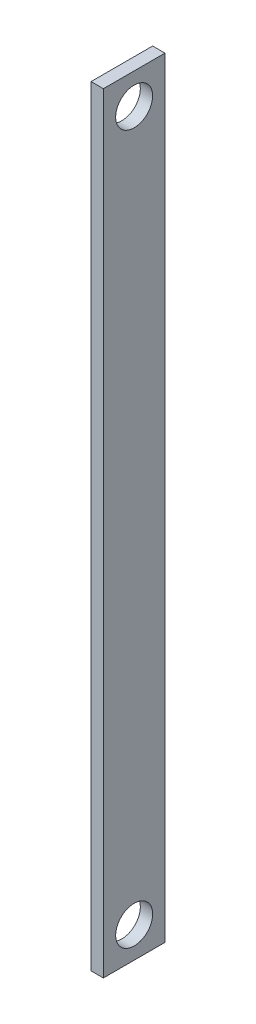
ISO-10303-21;
HEADER;
FILE_DESCRIPTION(('STEP AP214'),'2;1');
FILE_NAME('part.step','',(''),(''),'','','');
FILE_SCHEMA(('AUTOMOTIVE_DESIGN { 1 0 10303 214 1 1 1 1 }'));
ENDSEC;
DATA;
#1=APPLICATION_CONTEXT('core data for automotive mechanical design processes');
#2=APPLICATION_PROTOCOL_DEFINITION('international standard','automotive_design',2000,#1);
#3=PRODUCT_CONTEXT('',#1,'mechanical');
#4=PRODUCT('Part','Part','',(#3));
#5=PRODUCT_RELATED_PRODUCT_CATEGORY('part','',(#4));
#6=PRODUCT_DEFINITION_FORMATION('','',#4);
#7=PRODUCT_DEFINITION_CONTEXT('part definition',#1,'design');
#8=PRODUCT_DEFINITION('design','',#6,#7);
#9=PRODUCT_DEFINITION_SHAPE('','',#8);
#10=(LENGTH_UNIT() NAMED_UNIT(*) SI_UNIT(.MILLI.,.METRE.));
#11=(NAMED_UNIT(*) PLANE_ANGLE_UNIT() SI_UNIT($,.RADIAN.));
#12=(NAMED_UNIT(*) SI_UNIT($,.STERADIAN.) SOLID_ANGLE_UNIT());
#13=UNCERTAINTY_MEASURE_WITH_UNIT(LENGTH_MEASURE(1.E-05),#10,'distance_accuracy_value','');
#14=(GEOMETRIC_REPRESENTATION_CONTEXT(3) GLOBAL_UNCERTAINTY_ASSIGNED_CONTEXT((#13)) GLOBAL_UNIT_ASSIGNED_CONTEXT((#10,
#11,#12)) REPRESENTATION_CONTEXT('',''));
#15=CARTESIAN_POINT('',(0.,0.,0.));
#16=DIRECTION('',(0.,0.,1.));
#17=DIRECTION('',(1.,0.,0.));
#18=AXIS2_PLACEMENT_3D('',#15,#16,#17);
#19=CARTESIAN_POINT('',(2.,-62.5,-5.));
#20=DIRECTION('',(0.,0.,1.));
#21=DIRECTION('',(1.,0.,0.));
#22=AXIS2_PLACEMENT_3D('',#19,#20,#21);
#23=PLANE('',#22);
#24=DIRECTION('',(0.,1.,0.));
#25=VECTOR('',#24,1.);
#26=CARTESIAN_POINT('',(0.,-62.5,-5.));
#27=LINE('',#26,#25);
#28=CARTESIAN_POINT('',(0.,-62.5,-5.));
#29=VERTEX_POINT('',#28);
#30=CARTESIAN_POINT('',(0.,62.5,-5.));
#31=VERTEX_POINT('',#30);
#32=EDGE_CURVE('E96',#29,#31,#27,.T.);
#33=ORIENTED_EDGE('',*,*,#32,.T.);
#34=DIRECTION('',(-1.,0.,0.));
#35=VECTOR('',#34,1.);
#36=CARTESIAN_POINT('',(2.,62.5,-5.));
#37=LINE('',#36,#35);
#38=CARTESIAN_POINT('',(2.,62.5,-5.));
#39=VERTEX_POINT('',#38);
#40=EDGE_CURVE('E11',#39,#31,#37,.T.);
#41=ORIENTED_EDGE('',*,*,#40,.F.);
#42=DIRECTION('',(0.,1.,0.));
#43=VECTOR('',#42,1.);
#44=CARTESIAN_POINT('',(2.,-62.5,-5.));
#45=LINE('',#44,#43);
#46=CARTESIAN_POINT('',(2.,-62.5,-5.));
#47=VERTEX_POINT('',#46);
#48=EDGE_CURVE('E84',#47,#39,#45,.T.);
#49=ORIENTED_EDGE('',*,*,#48,.F.);
#50=DIRECTION('',(-1.,0.,0.));
#51=VECTOR('',#50,1.);
#52=CARTESIAN_POINT('',(2.,-62.5,-5.));
#53=LINE('',#52,#51);
#54=EDGE_CURVE('E92',#47,#29,#53,.T.);
#55=ORIENTED_EDGE('',*,*,#54,.T.);
#56=EDGE_LOOP('',(#33,#41,#49,#55));
#57=FACE_BOUND('',#56,.T.);
#58=ADVANCED_FACE('F33',(#57),#23,.F.);
#59=CARTESIAN_POINT('',(2.,62.5,5.));
#60=DIRECTION('',(0.,-1.,0.));
#61=DIRECTION('',(0.,0.,-1.));
#62=AXIS2_PLACEMENT_3D('',#59,#60,#61);
#63=PLANE('',#62);
#64=DIRECTION('',(0.,0.,1.));
#65=VECTOR('',#64,1.);
#66=CARTESIAN_POINT('',(0.,62.5,5.));
#67=LINE('',#66,#65);
#68=CARTESIAN_POINT('',(0.,62.5,5.));
#69=VERTEX_POINT('',#68);
#70=EDGE_CURVE('E88',#31,#69,#67,.T.);
#71=ORIENTED_EDGE('',*,*,#70,.T.);
#72=DIRECTION('',(-1.,0.,0.));
#73=VECTOR('',#72,1.);
#74=CARTESIAN_POINT('',(2.,62.5,5.));
#75=LINE('',#74,#73);
#76=CARTESIAN_POINT('',(2.,62.5,5.));
#77=VERTEX_POINT('',#76);
#78=EDGE_CURVE('E41',#77,#69,#75,.T.);
#79=ORIENTED_EDGE('',*,*,#78,.F.);
#80=DIRECTION('',(0.,0.,1.));
#81=VECTOR('',#80,1.);
#82=CARTESIAN_POINT('',(2.,62.5,5.));
#83=LINE('',#82,#81);
#84=EDGE_CURVE('E79',#39,#77,#83,.T.);
#85=ORIENTED_EDGE('',*,*,#84,.F.);
#86=ORIENTED_EDGE('',*,*,#40,.T.);
#87=EDGE_LOOP('',(#71,#79,#85,#86));
#88=FACE_BOUND('',#87,.T.);
#89=ADVANCED_FACE('F87',(#88),#63,.F.);
#90=CARTESIAN_POINT('',(2.,-62.5,5.));
#91=DIRECTION('',(0.,0.,-1.));
#92=DIRECTION('',(-1.,0.,0.));
#93=AXIS2_PLACEMENT_3D('',#90,#91,#92);
#94=PLANE('',#93);
#95=DIRECTION('',(0.,-1.,0.));
#96=VECTOR('',#95,1.);
#97=CARTESIAN_POINT('',(0.,-62.5,5.));
#98=LINE('',#97,#96);
#99=CARTESIAN_POINT('',(0.,-62.5,5.));
#100=VERTEX_POINT('',#99);
#101=EDGE_CURVE('E66',#69,#100,#98,.T.);
#102=ORIENTED_EDGE('',*,*,#101,.T.);
#103=DIRECTION('',(-1.,0.,0.));
#104=VECTOR('',#103,1.);
#105=CARTESIAN_POINT('',(2.,-62.5,5.));
#106=LINE('',#105,#104);
#107=CARTESIAN_POINT('',(2.,-62.5,5.));
#108=VERTEX_POINT('',#107);
#109=EDGE_CURVE('E89',#108,#100,#106,.T.);
#110=ORIENTED_EDGE('',*,*,#109,.F.);
#111=DIRECTION('',(0.,-1.,0.));
#112=VECTOR('',#111,1.);
#113=CARTESIAN_POINT('',(2.,-62.5,5.));
#114=LINE('',#113,#112);
#115=EDGE_CURVE('E82',#77,#108,#114,.T.);
#116=ORIENTED_EDGE('',*,*,#115,.F.);
#117=ORIENTED_EDGE('',*,*,#78,.T.);
#118=EDGE_LOOP('',(#102,#110,#116,#117));
#119=FACE_BOUND('',#118,.T.);
#120=ADVANCED_FACE('F90',(#119),#94,.F.);
#121=CARTESIAN_POINT('',(2.,-62.5,5.));
#122=DIRECTION('',(0.,1.,0.));
#123=DIRECTION('',(0.,0.,1.));
#124=AXIS2_PLACEMENT_3D('',#121,#122,#123);
#125=PLANE('',#124);
#126=DIRECTION('',(0.,0.,-1.));
#127=VECTOR('',#126,1.);
#128=CARTESIAN_POINT('',(0.,-62.5,5.));
#129=LINE('',#128,#127);
#130=EDGE_CURVE('E72',#100,#29,#129,.T.);
#131=ORIENTED_EDGE('',*,*,#130,.T.);
#132=ORIENTED_EDGE('',*,*,#54,.F.);
#133=DIRECTION('',(0.,0.,-1.));
#134=VECTOR('',#133,1.);
#135=CARTESIAN_POINT('',(2.,-62.5,5.));
#136=LINE('',#135,#134);
#137=EDGE_CURVE('E49',#108,#47,#136,.T.);
#138=ORIENTED_EDGE('',*,*,#137,.F.);
#139=ORIENTED_EDGE('',*,*,#109,.T.);
#140=EDGE_LOOP('',(#131,#132,#138,#139));
#141=FACE_BOUND('',#140,.T.);
#142=ADVANCED_FACE('F104',(#141),#125,.F.);
#143=CARTESIAN_POINT('',(2.,0.,0.));
#144=DIRECTION('',(-1.,0.,0.));
#145=DIRECTION('',(0.,0.,1.));
#146=AXIS2_PLACEMENT_3D('',#143,#144,#145);
#147=PLANE('',#146);
#148=CARTESIAN_POINT('',(2.,-57.5,-1.20456106190088E-12));
#149=DIRECTION('',(1.,0.,0.));
#150=DIRECTION('',(0.,0.,-1.));
#151=AXIS2_PLACEMENT_3D('',#148,#149,#150);
#152=CIRCLE('',#151,3.);
#153=CARTESIAN_POINT('',(2.,-57.5,-3.00000000000121));
#154=VERTEX_POINT('',#153);
#155=EDGE_CURVE('E118',#154,#154,#152,.T.);
#156=ORIENTED_EDGE('',*,*,#155,.F.);
#157=EDGE_LOOP('',(#156));
#158=FACE_BOUND('',#157,.T.);
#159=CARTESIAN_POINT('',(2.,57.5,0.));
#160=DIRECTION('',(1.,0.,0.));
#161=DIRECTION('',(0.,0.,-1.));
#162=AXIS2_PLACEMENT_3D('',#159,#160,#161);
#163=CIRCLE('',#162,3.);
#164=CARTESIAN_POINT('',(2.,57.5,-3.));
#165=VERTEX_POINT('',#164);
#166=EDGE_CURVE('E112',#165,#165,#163,.T.);
#167=ORIENTED_EDGE('',*,*,#166,.F.);
#168=EDGE_LOOP('',(#167));
#169=FACE_BOUND('',#168,.T.);
#170=ORIENTED_EDGE('',*,*,#48,.T.);
#171=ORIENTED_EDGE('',*,*,#84,.T.);
#172=ORIENTED_EDGE('',*,*,#115,.T.);
#173=ORIENTED_EDGE('',*,*,#137,.T.);
#174=EDGE_LOOP('',(#170,#171,#172,#173));
#175=FACE_BOUND('',#174,.T.);
#176=ADVANCED_FACE('F80',(#158,#169,#175),#147,.F.);
#177=CARTESIAN_POINT('',(0.,0.,0.));
#178=DIRECTION('',(-1.,0.,0.));
#179=DIRECTION('',(0.,0.,1.));
#180=AXIS2_PLACEMENT_3D('',#177,#178,#179);
#181=PLANE('',#180);
#182=CARTESIAN_POINT('',(0.,-57.5,-1.20456106190088E-12));
#183=DIRECTION('',(-1.,0.,0.));
#184=DIRECTION('',(0.,0.,1.));
#185=AXIS2_PLACEMENT_3D('',#182,#183,#184);
#186=CIRCLE('',#185,3.);
#187=CARTESIAN_POINT('',(0.,-57.5,2.9999999999988));
#188=VERTEX_POINT('',#187);
#189=EDGE_CURVE('E115',#188,#188,#186,.F.);
#190=ORIENTED_EDGE('',*,*,#189,.T.);
#191=EDGE_LOOP('',(#190));
#192=FACE_BOUND('',#191,.T.);
#193=CARTESIAN_POINT('',(0.,57.5,0.));
#194=DIRECTION('',(-1.,0.,0.));
#195=DIRECTION('',(0.,0.,1.));
#196=AXIS2_PLACEMENT_3D('',#193,#194,#195);
#197=CIRCLE('',#196,3.);
#198=CARTESIAN_POINT('',(0.,57.5,3.));
#199=VERTEX_POINT('',#198);
#200=EDGE_CURVE('E99',#199,#199,#197,.F.);
#201=ORIENTED_EDGE('',*,*,#200,.T.);
#202=EDGE_LOOP('',(#201));
#203=FACE_BOUND('',#202,.T.);
#204=ORIENTED_EDGE('',*,*,#32,.F.);
#205=ORIENTED_EDGE('',*,*,#130,.F.);
#206=ORIENTED_EDGE('',*,*,#101,.F.);
#207=ORIENTED_EDGE('',*,*,#70,.F.);
#208=EDGE_LOOP('',(#204,#205,#206,#207));
#209=FACE_BOUND('',#208,.T.);
#210=ADVANCED_FACE('F107',(#192,#203,#209),#181,.T.);
#211=CARTESIAN_POINT('',(-8.48528137423858,57.5,0.));
#212=DIRECTION('',(1.,0.,0.));
#213=DIRECTION('',(0.,0.,-1.));
#214=AXIS2_PLACEMENT_3D('',#211,#212,#213);
#215=CYLINDRICAL_SURFACE('',#214,3.);
#216=ORIENTED_EDGE('',*,*,#166,.T.);
#217=EDGE_LOOP('',(#216));
#218=FACE_BOUND('',#217,.T.);
#219=ORIENTED_EDGE('',*,*,#200,.F.);
#220=EDGE_LOOP('',(#219));
#221=FACE_BOUND('',#220,.T.);
#222=ADVANCED_FACE('F130',(#218,#221),#215,.F.);
#223=CARTESIAN_POINT('',(-8.48528137423858,-57.5,-1.20456106190088E-12));
#224=DIRECTION('',(1.,0.,0.));
#225=DIRECTION('',(0.,0.,-1.));
#226=AXIS2_PLACEMENT_3D('',#223,#224,#225);
#227=CYLINDRICAL_SURFACE('',#226,3.);
#228=ORIENTED_EDGE('',*,*,#155,.T.);
#229=EDGE_LOOP('',(#228));
#230=FACE_BOUND('',#229,.T.);
#231=ORIENTED_EDGE('',*,*,#189,.F.);
#232=EDGE_LOOP('',(#231));
#233=FACE_BOUND('',#232,.T.);
#234=ADVANCED_FACE('F122',(#230,#233),#227,.F.);
#235=CLOSED_SHELL('',(#58,#89,#120,#142,#176,#210,#222,#234));
#236=MANIFOLD_SOLID_BREP('B2',#235);
#237=ADVANCED_BREP_SHAPE_REPRESENTATION('',(#18,#236),#14);
#238=SHAPE_DEFINITION_REPRESENTATION(#9,#237);
ENDSEC;
END-ISO-10303-21;
